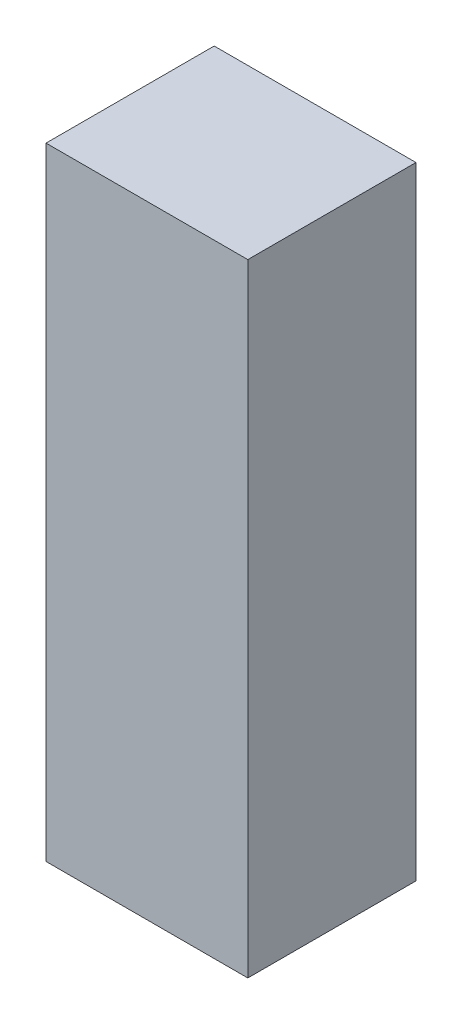
ISO-10303-21;
HEADER;
FILE_DESCRIPTION(('STEP AP214'),'2;1');
FILE_NAME('part.step','',(''),(''),'','','');
FILE_SCHEMA(('AUTOMOTIVE_DESIGN { 1 0 10303 214 1 1 1 1 }'));
ENDSEC;
DATA;
#1=APPLICATION_CONTEXT('core data for automotive mechanical design processes');
#2=APPLICATION_PROTOCOL_DEFINITION('international standard','automotive_design',2000,#1);
#3=PRODUCT_CONTEXT('',#1,'mechanical');
#4=PRODUCT('Part','Part','',(#3));
#5=PRODUCT_RELATED_PRODUCT_CATEGORY('part','',(#4));
#6=PRODUCT_DEFINITION_FORMATION('','',#4);
#7=PRODUCT_DEFINITION_CONTEXT('part definition',#1,'design');
#8=PRODUCT_DEFINITION('design','',#6,#7);
#9=PRODUCT_DEFINITION_SHAPE('','',#8);
#10=(LENGTH_UNIT() NAMED_UNIT(*) SI_UNIT(.MILLI.,.METRE.));
#11=(NAMED_UNIT(*) PLANE_ANGLE_UNIT() SI_UNIT($,.RADIAN.));
#12=(NAMED_UNIT(*) SI_UNIT($,.STERADIAN.) SOLID_ANGLE_UNIT());
#13=UNCERTAINTY_MEASURE_WITH_UNIT(LENGTH_MEASURE(1.E-05),#10,'distance_accuracy_value','');
#14=(GEOMETRIC_REPRESENTATION_CONTEXT(3) GLOBAL_UNCERTAINTY_ASSIGNED_CONTEXT((#13)) GLOBAL_UNIT_ASSIGNED_CONTEXT((#10,
#11,#12)) REPRESENTATION_CONTEXT('',''));
#15=CARTESIAN_POINT('',(0.,0.,0.));
#16=DIRECTION('',(0.,0.,1.));
#17=DIRECTION('',(1.,0.,0.));
#18=AXIS2_PLACEMENT_3D('',#15,#16,#17);
#19=CARTESIAN_POINT('',(0.24,-0.485,0.));
#20=DIRECTION('',(1.,0.,0.));
#21=DIRECTION('',(0.,0.,1.));
#22=AXIS2_PLACEMENT_3D('',#19,#20,#21);
#23=PLANE('',#22);
#24=DIRECTION('',(0.,1.,0.));
#25=VECTOR('',#24,1.);
#26=CARTESIAN_POINT('',(0.24,-0.485,0.1));
#27=LINE('',#26,#25);
#28=CARTESIAN_POINT('',(0.24,-0.485,0.1));
#29=VERTEX_POINT('',#28);
#30=CARTESIAN_POINT('',(0.24,-0.115,0.1));
#31=VERTEX_POINT('',#30);
#32=EDGE_CURVE('E11',#29,#31,#27,.T.);
#33=ORIENTED_EDGE('',*,*,#32,.T.);
#34=DIRECTION('',(0.,0.,1.));
#35=VECTOR('',#34,1.);
#36=CARTESIAN_POINT('',(0.24,-0.115,0.));
#37=LINE('',#36,#35);
#38=CARTESIAN_POINT('',(0.24,-0.115,0.));
#39=VERTEX_POINT('',#38);
#40=EDGE_CURVE('E24',#39,#31,#37,.T.);
#41=ORIENTED_EDGE('',*,*,#40,.F.);
#42=DIRECTION('',(0.,1.,0.));
#43=VECTOR('',#42,1.);
#44=CARTESIAN_POINT('',(0.24,-0.485,0.));
#45=LINE('',#44,#43);
#46=CARTESIAN_POINT('',(0.24,-0.485,0.));
#47=VERTEX_POINT('',#46);
#48=EDGE_CURVE('E86',#47,#39,#45,.T.);
#49=ORIENTED_EDGE('',*,*,#48,.F.);
#50=DIRECTION('',(0.,0.,1.));
#51=VECTOR('',#50,1.);
#52=CARTESIAN_POINT('',(0.24,-0.485,0.));
#53=LINE('',#52,#51);
#54=EDGE_CURVE('E36',#47,#29,#53,.T.);
#55=ORIENTED_EDGE('',*,*,#54,.T.);
#56=EDGE_LOOP('',(#33,#41,#49,#55));
#57=FACE_BOUND('',#56,.T.);
#58=ADVANCED_FACE('F17',(#57),#23,.F.);
#59=CARTESIAN_POINT('',(0.36,-0.485,0.));
#60=DIRECTION('',(1.,0.,0.));
#61=DIRECTION('',(0.,0.,1.));
#62=AXIS2_PLACEMENT_3D('',#59,#60,#61);
#63=PLANE('',#62);
#64=DIRECTION('',(0.,0.,1.));
#65=VECTOR('',#64,1.);
#66=CARTESIAN_POINT('',(0.36,-0.485,0.));
#67=LINE('',#66,#65);
#68=CARTESIAN_POINT('',(0.36,-0.485,0.));
#69=VERTEX_POINT('',#68);
#70=CARTESIAN_POINT('',(0.36,-0.485,0.1));
#71=VERTEX_POINT('',#70);
#72=EDGE_CURVE('E83',#69,#71,#67,.T.);
#73=ORIENTED_EDGE('',*,*,#72,.F.);
#74=DIRECTION('',(0.,1.,0.));
#75=VECTOR('',#74,1.);
#76=CARTESIAN_POINT('',(0.36,-0.485,0.));
#77=LINE('',#76,#75);
#78=CARTESIAN_POINT('',(0.36,-0.115,0.));
#79=VERTEX_POINT('',#78);
#80=EDGE_CURVE('E63',#69,#79,#77,.T.);
#81=ORIENTED_EDGE('',*,*,#80,.T.);
#82=DIRECTION('',(0.,0.,1.));
#83=VECTOR('',#82,1.);
#84=CARTESIAN_POINT('',(0.36,-0.115,0.));
#85=LINE('',#84,#83);
#86=CARTESIAN_POINT('',(0.36,-0.115,0.1));
#87=VERTEX_POINT('',#86);
#88=EDGE_CURVE('E57',#79,#87,#85,.T.);
#89=ORIENTED_EDGE('',*,*,#88,.T.);
#90=DIRECTION('',(0.,1.,0.));
#91=VECTOR('',#90,1.);
#92=CARTESIAN_POINT('',(0.36,-0.485,0.1));
#93=LINE('',#92,#91);
#94=EDGE_CURVE('E60',#71,#87,#93,.T.);
#95=ORIENTED_EDGE('',*,*,#94,.F.);
#96=EDGE_LOOP('',(#73,#81,#89,#95));
#97=FACE_BOUND('',#96,.T.);
#98=ADVANCED_FACE('F59',(#97),#63,.T.);
#99=CARTESIAN_POINT('',(0.24,-0.485,0.));
#100=DIRECTION('',(0.,1.,0.));
#101=DIRECTION('',(0.,0.,1.));
#102=AXIS2_PLACEMENT_3D('',#99,#100,#101);
#103=PLANE('',#102);
#104=ORIENTED_EDGE('',*,*,#72,.T.);
#105=DIRECTION('',(1.,0.,0.));
#106=VECTOR('',#105,1.);
#107=CARTESIAN_POINT('',(0.24,-0.485,0.1));
#108=LINE('',#107,#106);
#109=EDGE_CURVE('E71',#29,#71,#108,.T.);
#110=ORIENTED_EDGE('',*,*,#109,.F.);
#111=ORIENTED_EDGE('',*,*,#54,.F.);
#112=DIRECTION('',(1.,0.,0.));
#113=VECTOR('',#112,1.);
#114=CARTESIAN_POINT('',(0.24,-0.485,0.));
#115=LINE('',#114,#113);
#116=EDGE_CURVE('E76',#47,#69,#115,.T.);
#117=ORIENTED_EDGE('',*,*,#116,.T.);
#118=EDGE_LOOP('',(#104,#110,#111,#117));
#119=FACE_BOUND('',#118,.T.);
#120=ADVANCED_FACE('F91',(#119),#103,.F.);
#121=CARTESIAN_POINT('',(0.24,-0.115,0.));
#122=DIRECTION('',(0.,1.,0.));
#123=DIRECTION('',(0.,0.,1.));
#124=AXIS2_PLACEMENT_3D('',#121,#122,#123);
#125=PLANE('',#124);
#126=DIRECTION('',(1.,0.,0.));
#127=VECTOR('',#126,1.);
#128=CARTESIAN_POINT('',(0.24,-0.115,0.));
#129=LINE('',#128,#127);
#130=EDGE_CURVE('E74',#39,#79,#129,.T.);
#131=ORIENTED_EDGE('',*,*,#130,.F.);
#132=ORIENTED_EDGE('',*,*,#40,.T.);
#133=DIRECTION('',(1.,0.,0.));
#134=VECTOR('',#133,1.);
#135=CARTESIAN_POINT('',(0.24,-0.115,0.1));
#136=LINE('',#135,#134);
#137=EDGE_CURVE('E69',#31,#87,#136,.T.);
#138=ORIENTED_EDGE('',*,*,#137,.T.);
#139=ORIENTED_EDGE('',*,*,#88,.F.);
#140=EDGE_LOOP('',(#131,#132,#138,#139));
#141=FACE_BOUND('',#140,.T.);
#142=ADVANCED_FACE('F73',(#141),#125,.T.);
#143=CARTESIAN_POINT('',(0.24,-0.485,0.));
#144=DIRECTION('',(0.,0.,1.));
#145=DIRECTION('',(1.,0.,0.));
#146=AXIS2_PLACEMENT_3D('',#143,#144,#145);
#147=PLANE('',#146);
#148=ORIENTED_EDGE('',*,*,#130,.T.);
#149=ORIENTED_EDGE('',*,*,#80,.F.);
#150=ORIENTED_EDGE('',*,*,#116,.F.);
#151=ORIENTED_EDGE('',*,*,#48,.T.);
#152=EDGE_LOOP('',(#148,#149,#150,#151));
#153=FACE_BOUND('',#152,.T.);
#154=ADVANCED_FACE('F89',(#153),#147,.F.);
#155=CARTESIAN_POINT('',(0.24,-0.485,0.1));
#156=DIRECTION('',(0.,0.,1.));
#157=DIRECTION('',(1.,0.,0.));
#158=AXIS2_PLACEMENT_3D('',#155,#156,#157);
#159=PLANE('',#158);
#160=ORIENTED_EDGE('',*,*,#32,.F.);
#161=ORIENTED_EDGE('',*,*,#109,.T.);
#162=ORIENTED_EDGE('',*,*,#94,.T.);
#163=ORIENTED_EDGE('',*,*,#137,.F.);
#164=EDGE_LOOP('',(#160,#161,#162,#163));
#165=FACE_BOUND('',#164,.T.);
#166=ADVANCED_FACE('F68',(#165),#159,.T.);
#167=CLOSED_SHELL('',(#58,#98,#120,#142,#154,#166));
#168=MANIFOLD_SOLID_BREP('B1',#167);
#169=ADVANCED_BREP_SHAPE_REPRESENTATION('',(#18,#168),#14);
#170=SHAPE_DEFINITION_REPRESENTATION(#9,#169);
ENDSEC;
END-ISO-10303-21;
